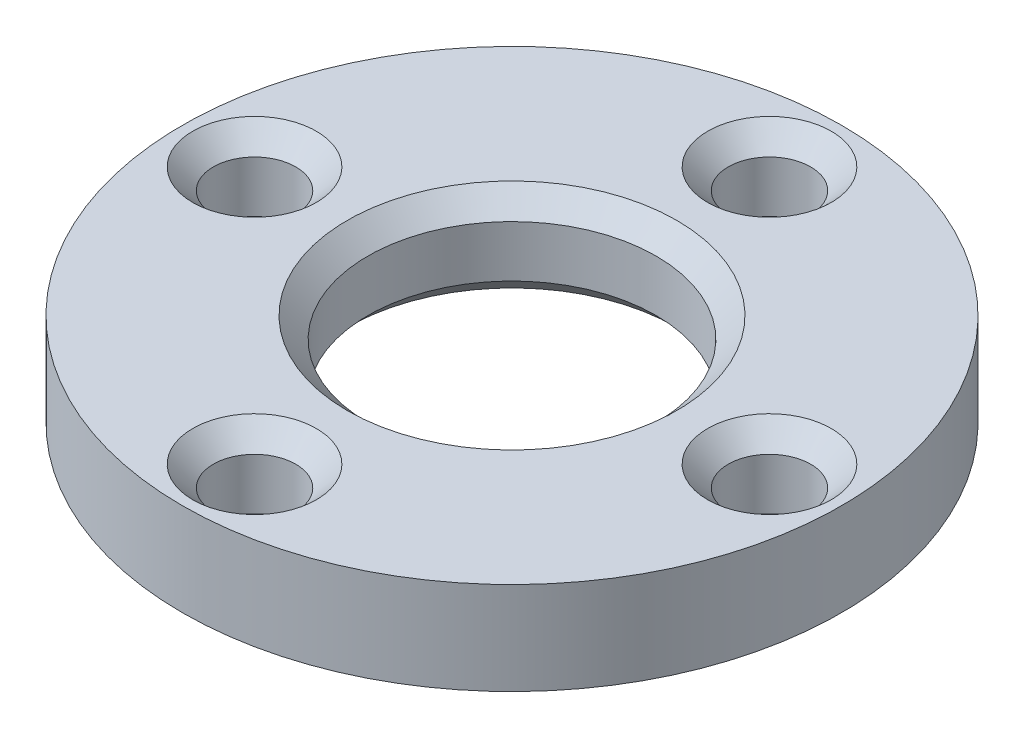
ISO-10303-21;
HEADER;
FILE_DESCRIPTION(('STEP AP214'),'2;1');
FILE_NAME('part.step','',(''),(''),'','','');
FILE_SCHEMA(('AUTOMOTIVE_DESIGN { 1 0 10303 214 1 1 1 1 }'));
ENDSEC;
DATA;
#1=APPLICATION_CONTEXT('core data for automotive mechanical design processes');
#2=APPLICATION_PROTOCOL_DEFINITION('international standard','automotive_design',2000,#1);
#3=PRODUCT_CONTEXT('',#1,'mechanical');
#4=PRODUCT('Part','Part','',(#3));
#5=PRODUCT_RELATED_PRODUCT_CATEGORY('part','',(#4));
#6=PRODUCT_DEFINITION_FORMATION('','',#4);
#7=PRODUCT_DEFINITION_CONTEXT('part definition',#1,'design');
#8=PRODUCT_DEFINITION('design','',#6,#7);
#9=PRODUCT_DEFINITION_SHAPE('','',#8);
#10=(LENGTH_UNIT() NAMED_UNIT(*) SI_UNIT(.MILLI.,.METRE.));
#11=(NAMED_UNIT(*) PLANE_ANGLE_UNIT() SI_UNIT($,.RADIAN.));
#12=(NAMED_UNIT(*) SI_UNIT($,.STERADIAN.) SOLID_ANGLE_UNIT());
#13=UNCERTAINTY_MEASURE_WITH_UNIT(LENGTH_MEASURE(1.E-05),#10,'distance_accuracy_value','');
#14=(GEOMETRIC_REPRESENTATION_CONTEXT(3) GLOBAL_UNCERTAINTY_ASSIGNED_CONTEXT((#13)) GLOBAL_UNIT_ASSIGNED_CONTEXT((#10,
#11,#12)) REPRESENTATION_CONTEXT('',''));
#15=CARTESIAN_POINT('',(0.,0.,0.));
#16=DIRECTION('',(0.,0.,1.));
#17=DIRECTION('',(1.,0.,0.));
#18=AXIS2_PLACEMENT_3D('',#15,#16,#17);
#19=CARTESIAN_POINT('',(0.,4.5,0.));
#20=DIRECTION('',(0.,1.,0.));
#21=DIRECTION('',(0.,0.,1.));
#22=AXIS2_PLACEMENT_3D('',#19,#20,#21);
#23=PLANE('',#22);
#24=CARTESIAN_POINT('',(12.5000000000003,4.5,-2.63750718516193E-13));
#25=DIRECTION('',(0.,1.,0.));
#26=DIRECTION('',(0.,0.,1.));
#27=AXIS2_PLACEMENT_3D('',#24,#25,#26);
#28=CIRCLE('',#27,3.);
#29=CARTESIAN_POINT('',(12.5000000000003,4.5,2.99999999999974));
#30=VERTEX_POINT('',#29);
#31=EDGE_CURVE('E10',#30,#30,#28,.F.);
#32=ORIENTED_EDGE('',*,*,#31,.T.);
#33=EDGE_LOOP('',(#32));
#34=FACE_BOUND('',#33,.T.);
#35=CARTESIAN_POINT('',(0.,4.5,-12.5));
#36=DIRECTION('',(0.,1.,0.));
#37=DIRECTION('',(0.,0.,1.));
#38=AXIS2_PLACEMENT_3D('',#35,#36,#37);
#39=CIRCLE('',#38,3.);
#40=CARTESIAN_POINT('',(0.,4.5,-9.5));
#41=VERTEX_POINT('',#40);
#42=EDGE_CURVE('E41',#41,#41,#39,.F.);
#43=ORIENTED_EDGE('',*,*,#42,.T.);
#44=EDGE_LOOP('',(#43));
#45=FACE_BOUND('',#44,.T.);
#46=CARTESIAN_POINT('',(-12.4999999999997,4.5,2.65281527015128E-13));
#47=DIRECTION('',(0.,1.,0.));
#48=DIRECTION('',(0.,0.,1.));
#49=AXIS2_PLACEMENT_3D('',#46,#47,#48);
#50=CIRCLE('',#49,3.);
#51=CARTESIAN_POINT('',(-12.4999999999997,4.5,3.00000000000027));
#52=VERTEX_POINT('',#51);
#53=EDGE_CURVE('E45',#52,#52,#50,.F.);
#54=ORIENTED_EDGE('',*,*,#53,.T.);
#55=EDGE_LOOP('',(#54));
#56=FACE_BOUND('',#55,.T.);
#57=CARTESIAN_POINT('',(5.27501437032387E-13,4.5,12.5));
#58=DIRECTION('',(0.,1.,0.));
#59=DIRECTION('',(0.,0.,1.));
#60=AXIS2_PLACEMENT_3D('',#57,#58,#59);
#61=CIRCLE('',#60,3.);
#62=CARTESIAN_POINT('',(5.27501437032387E-13,4.5,15.5));
#63=VERTEX_POINT('',#62);
#64=EDGE_CURVE('E49',#63,#63,#61,.F.);
#65=ORIENTED_EDGE('',*,*,#64,.T.);
#66=EDGE_LOOP('',(#65));
#67=FACE_BOUND('',#66,.T.);
#68=CARTESIAN_POINT('',(0.,4.5,0.));
#69=DIRECTION('',(0.,1.,0.));
#70=DIRECTION('',(0.,0.,1.));
#71=AXIS2_PLACEMENT_3D('',#68,#69,#70);
#72=CIRCLE('',#71,8.);
#73=CARTESIAN_POINT('',(0.,4.5,8.));
#74=VERTEX_POINT('',#73);
#75=EDGE_CURVE('E54',#74,#74,#72,.F.);
#76=ORIENTED_EDGE('',*,*,#75,.T.);
#77=EDGE_LOOP('',(#76));
#78=FACE_BOUND('',#77,.T.);
#79=CARTESIAN_POINT('',(0.,4.5,0.));
#80=DIRECTION('',(0.,1.,0.));
#81=DIRECTION('',(0.,0.,1.));
#82=AXIS2_PLACEMENT_3D('',#79,#80,#81);
#83=CIRCLE('',#82,16.);
#84=CARTESIAN_POINT('',(0.,4.5,16.));
#85=VERTEX_POINT('',#84);
#86=EDGE_CURVE('E102',#85,#85,#83,.T.);
#87=ORIENTED_EDGE('',*,*,#86,.T.);
#88=EDGE_LOOP('',(#87));
#89=FACE_BOUND('',#88,.T.);
#90=ADVANCED_FACE('F33',(#34,#45,#56,#67,#78,#89),#23,.T.);
#91=CARTESIAN_POINT('',(0.,0.,0.));
#92=DIRECTION('',(0.,1.,0.));
#93=DIRECTION('',(0.,0.,1.));
#94=AXIS2_PLACEMENT_3D('',#91,#92,#93);
#95=PLANE('',#94);
#96=CARTESIAN_POINT('',(0.,0.,0.));
#97=DIRECTION('',(0.,1.,0.));
#98=DIRECTION('',(0.,0.,1.));
#99=AXIS2_PLACEMENT_3D('',#96,#97,#98);
#100=CIRCLE('',#99,7.99999999999999);
#101=CARTESIAN_POINT('',(0.,0.,7.99999999999999));
#102=VERTEX_POINT('',#101);
#103=EDGE_CURVE('E87',#102,#102,#100,.T.);
#104=ORIENTED_EDGE('',*,*,#103,.T.);
#105=EDGE_LOOP('',(#104));
#106=FACE_BOUND('',#105,.T.);
#107=CARTESIAN_POINT('',(-12.4999999999997,0.,2.65281527015128E-13));
#108=DIRECTION('',(0.,1.,0.));
#109=DIRECTION('',(0.,0.,1.));
#110=AXIS2_PLACEMENT_3D('',#107,#108,#109);
#111=CIRCLE('',#110,3.);
#112=CARTESIAN_POINT('',(-12.4999999999997,0.,3.00000000000027));
#113=VERTEX_POINT('',#112);
#114=EDGE_CURVE('E90',#113,#113,#111,.T.);
#115=ORIENTED_EDGE('',*,*,#114,.T.);
#116=EDGE_LOOP('',(#115));
#117=FACE_BOUND('',#116,.T.);
#118=CARTESIAN_POINT('',(0.,0.,-12.5));
#119=DIRECTION('',(0.,1.,0.));
#120=DIRECTION('',(0.,0.,1.));
#121=AXIS2_PLACEMENT_3D('',#118,#119,#120);
#122=CIRCLE('',#121,3.);
#123=CARTESIAN_POINT('',(0.,0.,-9.5));
#124=VERTEX_POINT('',#123);
#125=EDGE_CURVE('E93',#124,#124,#122,.T.);
#126=ORIENTED_EDGE('',*,*,#125,.T.);
#127=EDGE_LOOP('',(#126));
#128=FACE_BOUND('',#127,.T.);
#129=CARTESIAN_POINT('',(12.5000000000003,0.,-2.63750718516193E-13));
#130=DIRECTION('',(0.,1.,0.));
#131=DIRECTION('',(0.,0.,1.));
#132=AXIS2_PLACEMENT_3D('',#129,#130,#131);
#133=CIRCLE('',#132,3.);
#134=CARTESIAN_POINT('',(12.5000000000003,0.,2.99999999999974));
#135=VERTEX_POINT('',#134);
#136=EDGE_CURVE('E96',#135,#135,#133,.T.);
#137=ORIENTED_EDGE('',*,*,#136,.T.);
#138=EDGE_LOOP('',(#137));
#139=FACE_BOUND('',#138,.T.);
#140=CARTESIAN_POINT('',(5.27501437032387E-13,0.,12.5));
#141=DIRECTION('',(0.,1.,0.));
#142=DIRECTION('',(0.,0.,1.));
#143=AXIS2_PLACEMENT_3D('',#140,#141,#142);
#144=CIRCLE('',#143,3.);
#145=CARTESIAN_POINT('',(5.27501437032387E-13,0.,15.5));
#146=VERTEX_POINT('',#145);
#147=EDGE_CURVE('E99',#146,#146,#144,.T.);
#148=ORIENTED_EDGE('',*,*,#147,.T.);
#149=EDGE_LOOP('',(#148));
#150=FACE_BOUND('',#149,.T.);
#151=CARTESIAN_POINT('',(0.,0.,0.));
#152=DIRECTION('',(0.,1.,0.));
#153=DIRECTION('',(0.,0.,1.));
#154=AXIS2_PLACEMENT_3D('',#151,#152,#153);
#155=CIRCLE('',#154,16.);
#156=CARTESIAN_POINT('',(0.,0.,16.));
#157=VERTEX_POINT('',#156);
#158=EDGE_CURVE('E103',#157,#157,#155,.T.);
#159=ORIENTED_EDGE('',*,*,#158,.F.);
#160=EDGE_LOOP('',(#159));
#161=FACE_BOUND('',#160,.T.);
#162=ADVANCED_FACE('F114',(#106,#117,#128,#139,#150,#161),#95,.F.);
#163=CARTESIAN_POINT('',(0.,4.5,0.));
#164=DIRECTION('',(0.,-1.,0.));
#165=DIRECTION('',(0.,0.,-1.));
#166=AXIS2_PLACEMENT_3D('',#163,#164,#165);
#167=CYLINDRICAL_SURFACE('',#166,16.);
#168=ORIENTED_EDGE('',*,*,#86,.F.);
#169=EDGE_LOOP('',(#168));
#170=FACE_BOUND('',#169,.T.);
#171=ORIENTED_EDGE('',*,*,#158,.T.);
#172=EDGE_LOOP('',(#171));
#173=FACE_BOUND('',#172,.T.);
#174=ADVANCED_FACE('F110',(#170,#173),#167,.T.);
#175=CARTESIAN_POINT('',(0.,4.5,0.));
#176=DIRECTION('',(0.,-1.,0.));
#177=DIRECTION('',(0.,0.,-1.));
#178=AXIS2_PLACEMENT_3D('',#175,#176,#177);
#179=CYLINDRICAL_SURFACE('',#178,7.);
#180=CARTESIAN_POINT('',(0.,0.999999999999997,0.));
#181=DIRECTION('',(0.,1.,0.));
#182=DIRECTION('',(0.,0.,1.));
#183=AXIS2_PLACEMENT_3D('',#180,#181,#182);
#184=CIRCLE('',#183,7.);
#185=CARTESIAN_POINT('',(0.,0.999999999999997,7.));
#186=VERTEX_POINT('',#185);
#187=EDGE_CURVE('E81',#186,#186,#184,.F.);
#188=ORIENTED_EDGE('',*,*,#187,.T.);
#189=EDGE_LOOP('',(#188));
#190=FACE_BOUND('',#189,.T.);
#191=CARTESIAN_POINT('',(0.,3.5,0.));
#192=DIRECTION('',(0.,1.,0.));
#193=DIRECTION('',(0.,0.,1.));
#194=AXIS2_PLACEMENT_3D('',#191,#192,#193);
#195=CIRCLE('',#194,7.);
#196=CARTESIAN_POINT('',(0.,3.5,7.));
#197=VERTEX_POINT('',#196);
#198=EDGE_CURVE('E84',#197,#197,#195,.T.);
#199=ORIENTED_EDGE('',*,*,#198,.T.);
#200=EDGE_LOOP('',(#199));
#201=FACE_BOUND('',#200,.T.);
#202=ADVANCED_FACE('F113',(#190,#201),#179,.F.);
#203=CARTESIAN_POINT('',(0.,4.5,-12.5));
#204=DIRECTION('',(0.,-1.,0.));
#205=DIRECTION('',(0.,0.,-1.));
#206=AXIS2_PLACEMENT_3D('',#203,#204,#205);
#207=CYLINDRICAL_SURFACE('',#206,2.);
#208=CARTESIAN_POINT('',(0.,1.00000000000001,-12.5));
#209=DIRECTION('',(0.,1.,0.));
#210=DIRECTION('',(0.,0.,1.));
#211=AXIS2_PLACEMENT_3D('',#208,#209,#210);
#212=CIRCLE('',#211,2.);
#213=CARTESIAN_POINT('',(0.,1.00000000000001,-10.5));
#214=VERTEX_POINT('',#213);
#215=EDGE_CURVE('E69',#214,#214,#212,.F.);
#216=ORIENTED_EDGE('',*,*,#215,.T.);
#217=EDGE_LOOP('',(#216));
#218=FACE_BOUND('',#217,.T.);
#219=CARTESIAN_POINT('',(0.,3.5,-12.5));
#220=DIRECTION('',(0.,1.,0.));
#221=DIRECTION('',(0.,0.,1.));
#222=AXIS2_PLACEMENT_3D('',#219,#220,#221);
#223=CIRCLE('',#222,2.);
#224=CARTESIAN_POINT('',(0.,3.5,-10.5));
#225=VERTEX_POINT('',#224);
#226=EDGE_CURVE('E72',#225,#225,#223,.T.);
#227=ORIENTED_EDGE('',*,*,#226,.T.);
#228=EDGE_LOOP('',(#227));
#229=FACE_BOUND('',#228,.T.);
#230=ADVANCED_FACE('F209',(#218,#229),#207,.F.);
#231=CARTESIAN_POINT('',(12.5000000000003,4.5,-2.63750718516193E-13));
#232=DIRECTION('',(0.,-1.,0.));
#233=DIRECTION('',(0.,0.,-1.));
#234=AXIS2_PLACEMENT_3D('',#231,#232,#233);
#235=CYLINDRICAL_SURFACE('',#234,2.);
#236=CARTESIAN_POINT('',(12.5000000000003,1.00000000000001,-2.63750718516193E-13));
#237=DIRECTION('',(0.,1.,0.));
#238=DIRECTION('',(0.,0.,1.));
#239=AXIS2_PLACEMENT_3D('',#236,#237,#238);
#240=CIRCLE('',#239,2.);
#241=CARTESIAN_POINT('',(12.5000000000003,1.00000000000001,1.99999999999974));
#242=VERTEX_POINT('',#241);
#243=EDGE_CURVE('E63',#242,#242,#240,.F.);
#244=ORIENTED_EDGE('',*,*,#243,.T.);
#245=EDGE_LOOP('',(#244));
#246=FACE_BOUND('',#245,.T.);
#247=CARTESIAN_POINT('',(12.5000000000003,3.5,-2.63750718516193E-13));
#248=DIRECTION('',(0.,1.,0.));
#249=DIRECTION('',(0.,0.,1.));
#250=AXIS2_PLACEMENT_3D('',#247,#248,#249);
#251=CIRCLE('',#250,2.);
#252=CARTESIAN_POINT('',(12.5000000000003,3.5,1.99999999999974));
#253=VERTEX_POINT('',#252);
#254=EDGE_CURVE('E66',#253,#253,#251,.T.);
#255=ORIENTED_EDGE('',*,*,#254,.T.);
#256=EDGE_LOOP('',(#255));
#257=FACE_BOUND('',#256,.T.);
#258=ADVANCED_FACE('F200',(#246,#257),#235,.F.);
#259=CARTESIAN_POINT('',(5.27501437032387E-13,4.5,12.5));
#260=DIRECTION('',(0.,-1.,0.));
#261=DIRECTION('',(0.,0.,-1.));
#262=AXIS2_PLACEMENT_3D('',#259,#260,#261);
#263=CYLINDRICAL_SURFACE('',#262,2.);
#264=CARTESIAN_POINT('',(5.27501437032387E-13,1.00000000000001,12.5));
#265=DIRECTION('',(0.,1.,0.));
#266=DIRECTION('',(0.,0.,1.));
#267=AXIS2_PLACEMENT_3D('',#264,#265,#266);
#268=CIRCLE('',#267,2.);
#269=CARTESIAN_POINT('',(5.27501437032387E-13,1.00000000000001,14.5));
#270=VERTEX_POINT('',#269);
#271=EDGE_CURVE('E57',#270,#270,#268,.F.);
#272=ORIENTED_EDGE('',*,*,#271,.T.);
#273=EDGE_LOOP('',(#272));
#274=FACE_BOUND('',#273,.T.);
#275=CARTESIAN_POINT('',(5.27501437032387E-13,3.5,12.5));
#276=DIRECTION('',(0.,1.,0.));
#277=DIRECTION('',(0.,0.,1.));
#278=AXIS2_PLACEMENT_3D('',#275,#276,#277);
#279=CIRCLE('',#278,2.);
#280=CARTESIAN_POINT('',(5.27501437032387E-13,3.5,14.5));
#281=VERTEX_POINT('',#280);
#282=EDGE_CURVE('E60',#281,#281,#279,.T.);
#283=ORIENTED_EDGE('',*,*,#282,.T.);
#284=EDGE_LOOP('',(#283));
#285=FACE_BOUND('',#284,.T.);
#286=ADVANCED_FACE('F198',(#274,#285),#263,.F.);
#287=CARTESIAN_POINT('',(-12.4999999999997,4.5,2.65281527015128E-13));
#288=DIRECTION('',(0.,-1.,0.));
#289=DIRECTION('',(0.,0.,-1.));
#290=AXIS2_PLACEMENT_3D('',#287,#288,#289);
#291=CYLINDRICAL_SURFACE('',#290,2.);
#292=CARTESIAN_POINT('',(-12.4999999999997,1.00000000000001,2.65281527015128E-13));
#293=DIRECTION('',(0.,1.,0.));
#294=DIRECTION('',(0.,0.,1.));
#295=AXIS2_PLACEMENT_3D('',#292,#293,#294);
#296=CIRCLE('',#295,2.);
#297=CARTESIAN_POINT('',(-12.4999999999997,1.00000000000001,2.00000000000027));
#298=VERTEX_POINT('',#297);
#299=EDGE_CURVE('E75',#298,#298,#296,.F.);
#300=ORIENTED_EDGE('',*,*,#299,.T.);
#301=EDGE_LOOP('',(#300));
#302=FACE_BOUND('',#301,.T.);
#303=CARTESIAN_POINT('',(-12.4999999999997,3.5,2.65281527015128E-13));
#304=DIRECTION('',(0.,1.,0.));
#305=DIRECTION('',(0.,0.,1.));
#306=AXIS2_PLACEMENT_3D('',#303,#304,#305);
#307=CIRCLE('',#306,2.);
#308=CARTESIAN_POINT('',(-12.4999999999997,3.5,2.00000000000027));
#309=VERTEX_POINT('',#308);
#310=EDGE_CURVE('E78',#309,#309,#307,.T.);
#311=ORIENTED_EDGE('',*,*,#310,.T.);
#312=EDGE_LOOP('',(#311));
#313=FACE_BOUND('',#312,.T.);
#314=ADVANCED_FACE('F136',(#302,#313),#291,.F.);
#315=CARTESIAN_POINT('',(0.,0.,0.));
#316=DIRECTION('',(0.,-1.,0.));
#317=DIRECTION('',(0.,0.,-1.));
#318=AXIS2_PLACEMENT_3D('',#315,#316,#317);
#319=CONICAL_SURFACE('',#318,7.99999999999999,0.785398163397445);
#320=ORIENTED_EDGE('',*,*,#187,.F.);
#321=EDGE_LOOP('',(#320));
#322=FACE_BOUND('',#321,.T.);
#323=ORIENTED_EDGE('',*,*,#103,.F.);
#324=EDGE_LOOP('',(#323));
#325=FACE_BOUND('',#324,.T.);
#326=ADVANCED_FACE('F129',(#322,#325),#319,.F.);
#327=CARTESIAN_POINT('',(-12.4999999999997,0.,2.65281527015128E-13));
#328=DIRECTION('',(0.,-1.,0.));
#329=DIRECTION('',(0.,0.,-1.));
#330=AXIS2_PLACEMENT_3D('',#327,#328,#329);
#331=CONICAL_SURFACE('',#330,3.,0.785398163397445);
#332=ORIENTED_EDGE('',*,*,#299,.F.);
#333=EDGE_LOOP('',(#332));
#334=FACE_BOUND('',#333,.T.);
#335=ORIENTED_EDGE('',*,*,#114,.F.);
#336=EDGE_LOOP('',(#335));
#337=FACE_BOUND('',#336,.T.);
#338=ADVANCED_FACE('F135',(#334,#337),#331,.F.);
#339=CARTESIAN_POINT('',(0.,0.,-12.5));
#340=DIRECTION('',(0.,-1.,0.));
#341=DIRECTION('',(0.,0.,-1.));
#342=AXIS2_PLACEMENT_3D('',#339,#340,#341);
#343=CONICAL_SURFACE('',#342,3.,0.785398163397445);
#344=ORIENTED_EDGE('',*,*,#215,.F.);
#345=EDGE_LOOP('',(#344));
#346=FACE_BOUND('',#345,.T.);
#347=ORIENTED_EDGE('',*,*,#125,.F.);
#348=EDGE_LOOP('',(#347));
#349=FACE_BOUND('',#348,.T.);
#350=ADVANCED_FACE('F143',(#346,#349),#343,.F.);
#351=CARTESIAN_POINT('',(12.5000000000003,0.,-2.63750718516193E-13));
#352=DIRECTION('',(0.,-1.,0.));
#353=DIRECTION('',(0.,0.,-1.));
#354=AXIS2_PLACEMENT_3D('',#351,#352,#353);
#355=CONICAL_SURFACE('',#354,3.,0.785398163397445);
#356=ORIENTED_EDGE('',*,*,#243,.F.);
#357=EDGE_LOOP('',(#356));
#358=FACE_BOUND('',#357,.T.);
#359=ORIENTED_EDGE('',*,*,#136,.F.);
#360=EDGE_LOOP('',(#359));
#361=FACE_BOUND('',#360,.T.);
#362=ADVANCED_FACE('F150',(#358,#361),#355,.F.);
#363=CARTESIAN_POINT('',(5.27501437032387E-13,0.,12.5));
#364=DIRECTION('',(0.,-1.,0.));
#365=DIRECTION('',(0.,0.,-1.));
#366=AXIS2_PLACEMENT_3D('',#363,#364,#365);
#367=CONICAL_SURFACE('',#366,3.,0.785398163397445);
#368=ORIENTED_EDGE('',*,*,#271,.F.);
#369=EDGE_LOOP('',(#368));
#370=FACE_BOUND('',#369,.T.);
#371=ORIENTED_EDGE('',*,*,#147,.F.);
#372=EDGE_LOOP('',(#371));
#373=FACE_BOUND('',#372,.T.);
#374=ADVANCED_FACE('F157',(#370,#373),#367,.F.);
#375=CARTESIAN_POINT('',(12.5000000000003,3.5,-2.63750718516193E-13));
#376=DIRECTION('',(0.,1.,0.));
#377=DIRECTION('',(0.,0.,1.));
#378=AXIS2_PLACEMENT_3D('',#375,#376,#377);
#379=CONICAL_SURFACE('',#378,2.,0.785398163397452);
#380=ORIENTED_EDGE('',*,*,#31,.F.);
#381=EDGE_LOOP('',(#380));
#382=FACE_BOUND('',#381,.T.);
#383=ORIENTED_EDGE('',*,*,#254,.F.);
#384=EDGE_LOOP('',(#383));
#385=FACE_BOUND('',#384,.T.);
#386=ADVANCED_FACE('F164',(#382,#385),#379,.F.);
#387=CARTESIAN_POINT('',(0.,3.5,-12.5));
#388=DIRECTION('',(0.,1.,0.));
#389=DIRECTION('',(0.,0.,1.));
#390=AXIS2_PLACEMENT_3D('',#387,#388,#389);
#391=CONICAL_SURFACE('',#390,2.,0.785398163397452);
#392=ORIENTED_EDGE('',*,*,#42,.F.);
#393=EDGE_LOOP('',(#392));
#394=FACE_BOUND('',#393,.T.);
#395=ORIENTED_EDGE('',*,*,#226,.F.);
#396=EDGE_LOOP('',(#395));
#397=FACE_BOUND('',#396,.T.);
#398=ADVANCED_FACE('F171',(#394,#397),#391,.F.);
#399=CARTESIAN_POINT('',(-12.4999999999997,3.5,2.65281527015128E-13));
#400=DIRECTION('',(0.,1.,0.));
#401=DIRECTION('',(0.,0.,1.));
#402=AXIS2_PLACEMENT_3D('',#399,#400,#401);
#403=CONICAL_SURFACE('',#402,2.,0.785398163397452);
#404=ORIENTED_EDGE('',*,*,#53,.F.);
#405=EDGE_LOOP('',(#404));
#406=FACE_BOUND('',#405,.T.);
#407=ORIENTED_EDGE('',*,*,#310,.F.);
#408=EDGE_LOOP('',(#407));
#409=FACE_BOUND('',#408,.T.);
#410=ADVANCED_FACE('F178',(#406,#409),#403,.F.);
#411=CARTESIAN_POINT('',(5.27501437032387E-13,3.5,12.5));
#412=DIRECTION('',(0.,1.,0.));
#413=DIRECTION('',(0.,0.,1.));
#414=AXIS2_PLACEMENT_3D('',#411,#412,#413);
#415=CONICAL_SURFACE('',#414,2.,0.785398163397452);
#416=ORIENTED_EDGE('',*,*,#64,.F.);
#417=EDGE_LOOP('',(#416));
#418=FACE_BOUND('',#417,.T.);
#419=ORIENTED_EDGE('',*,*,#282,.F.);
#420=EDGE_LOOP('',(#419));
#421=FACE_BOUND('',#420,.T.);
#422=ADVANCED_FACE('F184',(#418,#421),#415,.F.);
#423=CARTESIAN_POINT('',(0.,3.5,0.));
#424=DIRECTION('',(0.,1.,0.));
#425=DIRECTION('',(0.,0.,1.));
#426=AXIS2_PLACEMENT_3D('',#423,#424,#425);
#427=CONICAL_SURFACE('',#426,7.,0.78539816339745);
#428=ORIENTED_EDGE('',*,*,#75,.F.);
#429=EDGE_LOOP('',(#428));
#430=FACE_BOUND('',#429,.T.);
#431=ORIENTED_EDGE('',*,*,#198,.F.);
#432=EDGE_LOOP('',(#431));
#433=FACE_BOUND('',#432,.T.);
#434=ADVANCED_FACE('F36',(#430,#433),#427,.F.);
#435=CLOSED_SHELL('',(#90,#162,#174,#202,#230,#258,#286,#314,#326,#338,#350,#362,#374,#386,#398,
#410,#422,#434));
#436=MANIFOLD_SOLID_BREP('B2',#435);
#437=ADVANCED_BREP_SHAPE_REPRESENTATION('',(#18,#436),#14);
#438=SHAPE_DEFINITION_REPRESENTATION(#9,#437);
ENDSEC;
END-ISO-10303-21;
